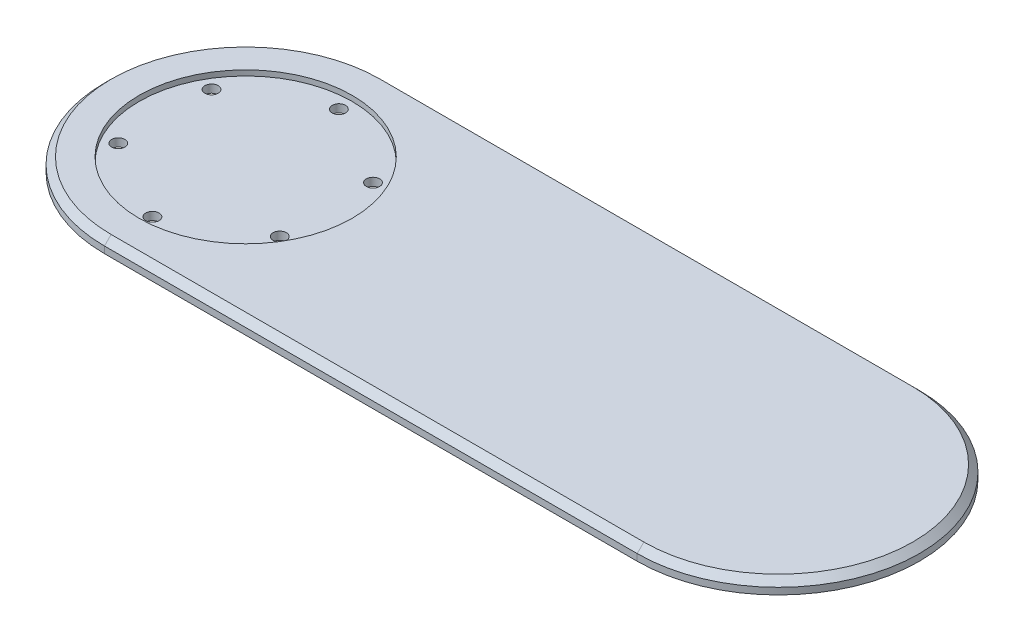
ISO-10303-21;
HEADER;
FILE_DESCRIPTION(('STEP AP214'),'2;1');
FILE_NAME('part.step','',(''),(''),'','','');
FILE_SCHEMA(('AUTOMOTIVE_DESIGN { 1 0 10303 214 1 1 1 1 }'));
ENDSEC;
DATA;
#1=APPLICATION_CONTEXT('core data for automotive mechanical design processes');
#2=APPLICATION_PROTOCOL_DEFINITION('international standard','automotive_design',2000,#1);
#3=PRODUCT_CONTEXT('',#1,'mechanical');
#4=PRODUCT('Part','Part','',(#3));
#5=PRODUCT_RELATED_PRODUCT_CATEGORY('part','',(#4));
#6=PRODUCT_DEFINITION_FORMATION('','',#4);
#7=PRODUCT_DEFINITION_CONTEXT('part definition',#1,'design');
#8=PRODUCT_DEFINITION('design','',#6,#7);
#9=PRODUCT_DEFINITION_SHAPE('','',#8);
#10=(LENGTH_UNIT() NAMED_UNIT(*) SI_UNIT(.MILLI.,.METRE.));
#11=(NAMED_UNIT(*) PLANE_ANGLE_UNIT() SI_UNIT($,.RADIAN.));
#12=(NAMED_UNIT(*) SI_UNIT($,.STERADIAN.) SOLID_ANGLE_UNIT());
#13=UNCERTAINTY_MEASURE_WITH_UNIT(LENGTH_MEASURE(1.E-05),#10,'distance_accuracy_value','');
#14=(GEOMETRIC_REPRESENTATION_CONTEXT(3) GLOBAL_UNCERTAINTY_ASSIGNED_CONTEXT((#13)) GLOBAL_UNIT_ASSIGNED_CONTEXT((#10,
#11,#12)) REPRESENTATION_CONTEXT('',''));
#15=CARTESIAN_POINT('',(0.,0.,0.));
#16=DIRECTION('',(0.,0.,1.));
#17=DIRECTION('',(1.,0.,0.));
#18=AXIS2_PLACEMENT_3D('',#15,#16,#17);
#19=CARTESIAN_POINT('',(-69.6891108675447,5.,17.5));
#20=DIRECTION('',(0.,-1.,0.));
#21=DIRECTION('',(0.,0.,-1.));
#22=AXIS2_PLACEMENT_3D('',#19,#20,#21);
#23=CYLINDRICAL_SURFACE('',#22,2.5);
#24=CARTESIAN_POINT('',(-69.6891108675447,0.,17.5));
#25=DIRECTION('',(0.,1.,0.));
#26=DIRECTION('',(0.,0.,1.));
#27=AXIS2_PLACEMENT_3D('',#24,#25,#26);
#28=CIRCLE('',#27,2.5);
#29=CARTESIAN_POINT('',(-69.6891108675447,0.,20.));
#30=VERTEX_POINT('',#29);
#31=EDGE_CURVE('E129',#30,#30,#28,.T.);
#32=ORIENTED_EDGE('',*,*,#31,.F.);
#33=EDGE_LOOP('',(#32));
#34=FACE_BOUND('',#33,.T.);
#35=CARTESIAN_POINT('',(-69.6891108675447,3.,17.5));
#36=DIRECTION('',(0.,1.,0.));
#37=DIRECTION('',(0.,0.,1.));
#38=AXIS2_PLACEMENT_3D('',#35,#36,#37);
#39=CIRCLE('',#38,2.5);
#40=CARTESIAN_POINT('',(-69.6891108675447,3.,20.));
#41=VERTEX_POINT('',#40);
#42=EDGE_CURVE('E113',#41,#41,#39,.T.);
#43=ORIENTED_EDGE('',*,*,#42,.T.);
#44=EDGE_LOOP('',(#43));
#45=FACE_BOUND('',#44,.T.);
#46=ADVANCED_FACE('F37',(#34,#45),#23,.F.);
#47=CARTESIAN_POINT('',(-100.,5.,35.));
#48=DIRECTION('',(0.,-1.,0.));
#49=DIRECTION('',(0.,0.,-1.));
#50=AXIS2_PLACEMENT_3D('',#47,#48,#49);
#51=CYLINDRICAL_SURFACE('',#50,2.50000000000001);
#52=CARTESIAN_POINT('',(-100.,0.,35.));
#53=DIRECTION('',(0.,1.,0.));
#54=DIRECTION('',(0.,0.,1.));
#55=AXIS2_PLACEMENT_3D('',#52,#53,#54);
#56=CIRCLE('',#55,2.50000000000001);
#57=CARTESIAN_POINT('',(-100.,0.,37.5));
#58=VERTEX_POINT('',#57);
#59=EDGE_CURVE('E126',#58,#58,#56,.T.);
#60=ORIENTED_EDGE('',*,*,#59,.F.);
#61=EDGE_LOOP('',(#60));
#62=FACE_BOUND('',#61,.T.);
#63=CARTESIAN_POINT('',(-100.,3.,35.));
#64=DIRECTION('',(0.,1.,0.));
#65=DIRECTION('',(0.,0.,1.));
#66=AXIS2_PLACEMENT_3D('',#63,#64,#65);
#67=CIRCLE('',#66,2.50000000000001);
#68=CARTESIAN_POINT('',(-100.,3.,37.5));
#69=VERTEX_POINT('',#68);
#70=EDGE_CURVE('E187',#69,#69,#67,.T.);
#71=ORIENTED_EDGE('',*,*,#70,.T.);
#72=EDGE_LOOP('',(#71));
#73=FACE_BOUND('',#72,.T.);
#74=ADVANCED_FACE('F220',(#62,#73),#51,.F.);
#75=CARTESIAN_POINT('',(-130.310889132455,5.,17.5));
#76=DIRECTION('',(0.,-1.,0.));
#77=DIRECTION('',(0.,0.,-1.));
#78=AXIS2_PLACEMENT_3D('',#75,#76,#77);
#79=CYLINDRICAL_SURFACE('',#78,2.5);
#80=CARTESIAN_POINT('',(-130.310889132455,0.,17.5));
#81=DIRECTION('',(0.,1.,0.));
#82=DIRECTION('',(0.,0.,1.));
#83=AXIS2_PLACEMENT_3D('',#80,#81,#82);
#84=CIRCLE('',#83,2.5);
#85=CARTESIAN_POINT('',(-130.310889132455,0.,20.));
#86=VERTEX_POINT('',#85);
#87=EDGE_CURVE('E123',#86,#86,#84,.T.);
#88=ORIENTED_EDGE('',*,*,#87,.F.);
#89=EDGE_LOOP('',(#88));
#90=FACE_BOUND('',#89,.T.);
#91=CARTESIAN_POINT('',(-130.310889132455,3.,17.5));
#92=DIRECTION('',(0.,1.,0.));
#93=DIRECTION('',(0.,0.,1.));
#94=AXIS2_PLACEMENT_3D('',#91,#92,#93);
#95=CIRCLE('',#94,2.5);
#96=CARTESIAN_POINT('',(-130.310889132455,3.,20.));
#97=VERTEX_POINT('',#96);
#98=EDGE_CURVE('E184',#97,#97,#95,.T.);
#99=ORIENTED_EDGE('',*,*,#98,.T.);
#100=EDGE_LOOP('',(#99));
#101=FACE_BOUND('',#100,.T.);
#102=ADVANCED_FACE('F226',(#90,#101),#79,.F.);
#103=CARTESIAN_POINT('',(-130.310889132455,5.,-17.5));
#104=DIRECTION('',(0.,-1.,0.));
#105=DIRECTION('',(0.,0.,-1.));
#106=AXIS2_PLACEMENT_3D('',#103,#104,#105);
#107=CYLINDRICAL_SURFACE('',#106,2.5);
#108=CARTESIAN_POINT('',(-130.310889132455,0.,-17.5));
#109=DIRECTION('',(0.,1.,0.));
#110=DIRECTION('',(0.,0.,1.));
#111=AXIS2_PLACEMENT_3D('',#108,#109,#110);
#112=CIRCLE('',#111,2.5);
#113=CARTESIAN_POINT('',(-130.310889132455,0.,-15.));
#114=VERTEX_POINT('',#113);
#115=EDGE_CURVE('E120',#114,#114,#112,.T.);
#116=ORIENTED_EDGE('',*,*,#115,.F.);
#117=EDGE_LOOP('',(#116));
#118=FACE_BOUND('',#117,.T.);
#119=CARTESIAN_POINT('',(-130.310889132455,3.,-17.5));
#120=DIRECTION('',(0.,1.,0.));
#121=DIRECTION('',(0.,0.,1.));
#122=AXIS2_PLACEMENT_3D('',#119,#120,#121);
#123=CIRCLE('',#122,2.5);
#124=CARTESIAN_POINT('',(-130.310889132455,3.,-15.));
#125=VERTEX_POINT('',#124);
#126=EDGE_CURVE('E181',#125,#125,#123,.T.);
#127=ORIENTED_EDGE('',*,*,#126,.T.);
#128=EDGE_LOOP('',(#127));
#129=FACE_BOUND('',#128,.T.);
#130=ADVANCED_FACE('F235',(#118,#129),#107,.F.);
#131=CARTESIAN_POINT('',(-100.,5.,-35.));
#132=DIRECTION('',(0.,-1.,0.));
#133=DIRECTION('',(0.,0.,-1.));
#134=AXIS2_PLACEMENT_3D('',#131,#132,#133);
#135=CYLINDRICAL_SURFACE('',#134,2.50000000000001);
#136=CARTESIAN_POINT('',(-100.,0.,-35.));
#137=DIRECTION('',(0.,1.,0.));
#138=DIRECTION('',(0.,0.,1.));
#139=AXIS2_PLACEMENT_3D('',#136,#137,#138);
#140=CIRCLE('',#139,2.50000000000001);
#141=CARTESIAN_POINT('',(-100.,0.,-32.5));
#142=VERTEX_POINT('',#141);
#143=EDGE_CURVE('E110',#142,#142,#140,.T.);
#144=ORIENTED_EDGE('',*,*,#143,.F.);
#145=EDGE_LOOP('',(#144));
#146=FACE_BOUND('',#145,.T.);
#147=CARTESIAN_POINT('',(-100.,3.,-35.));
#148=DIRECTION('',(0.,1.,0.));
#149=DIRECTION('',(0.,0.,1.));
#150=AXIS2_PLACEMENT_3D('',#147,#148,#149);
#151=CIRCLE('',#150,2.50000000000001);
#152=CARTESIAN_POINT('',(-100.,3.,-32.5));
#153=VERTEX_POINT('',#152);
#154=EDGE_CURVE('E142',#153,#153,#151,.T.);
#155=ORIENTED_EDGE('',*,*,#154,.T.);
#156=EDGE_LOOP('',(#155));
#157=FACE_BOUND('',#156,.T.);
#158=ADVANCED_FACE('F239',(#146,#157),#135,.F.);
#159=CARTESIAN_POINT('',(-69.6891108675446,5.,-17.5));
#160=DIRECTION('',(0.,-1.,0.));
#161=DIRECTION('',(0.,0.,-1.));
#162=AXIS2_PLACEMENT_3D('',#159,#160,#161);
#163=CYLINDRICAL_SURFACE('',#162,2.5);
#164=CARTESIAN_POINT('',(-69.6891108675446,0.,-17.5));
#165=DIRECTION('',(0.,1.,0.));
#166=DIRECTION('',(0.,0.,1.));
#167=AXIS2_PLACEMENT_3D('',#164,#165,#166);
#168=CIRCLE('',#167,2.5);
#169=CARTESIAN_POINT('',(-69.6891108675446,0.,-15.));
#170=VERTEX_POINT('',#169);
#171=EDGE_CURVE('E132',#170,#170,#168,.T.);
#172=ORIENTED_EDGE('',*,*,#171,.F.);
#173=EDGE_LOOP('',(#172));
#174=FACE_BOUND('',#173,.T.);
#175=CARTESIAN_POINT('',(-69.6891108675446,3.,-17.5));
#176=DIRECTION('',(0.,1.,0.));
#177=DIRECTION('',(0.,0.,1.));
#178=AXIS2_PLACEMENT_3D('',#175,#176,#177);
#179=CIRCLE('',#178,2.5);
#180=CARTESIAN_POINT('',(-69.6891108675446,3.,-15.));
#181=VERTEX_POINT('',#180);
#182=EDGE_CURVE('E139',#181,#181,#179,.T.);
#183=ORIENTED_EDGE('',*,*,#182,.T.);
#184=EDGE_LOOP('',(#183));
#185=FACE_BOUND('',#184,.T.);
#186=ADVANCED_FACE('F231',(#174,#185),#163,.F.);
#187=CARTESIAN_POINT('',(-100.,5.,0.));
#188=DIRECTION('',(0.,-1.,0.));
#189=DIRECTION('',(0.,0.,-1.));
#190=AXIS2_PLACEMENT_3D('',#187,#188,#189);
#191=CYLINDRICAL_SURFACE('',#190,53.);
#192=DIRECTION('',(0.,-1.,0.));
#193=VECTOR('',#192,1.);
#194=CARTESIAN_POINT('',(-100.,5.,53.));
#195=LINE('',#194,#193);
#196=CARTESIAN_POINT('',(-100.,2.50000000000003,53.));
#197=VERTEX_POINT('',#196);
#198=CARTESIAN_POINT('',(-100.,0.,53.));
#199=VERTEX_POINT('',#198);
#200=EDGE_CURVE('E89',#197,#199,#195,.T.);
#201=ORIENTED_EDGE('',*,*,#200,.F.);
#202=CARTESIAN_POINT('',(-100.,2.50000000000003,0.));
#203=DIRECTION('',(0.,1.,0.));
#204=DIRECTION('',(0.,0.,1.));
#205=AXIS2_PLACEMENT_3D('',#202,#203,#204);
#206=CIRCLE('',#205,53.);
#207=CARTESIAN_POINT('',(-100.,2.50000000000003,-53.));
#208=VERTEX_POINT('',#207);
#209=EDGE_CURVE('E47',#197,#208,#206,.F.);
#210=ORIENTED_EDGE('',*,*,#209,.T.);
#211=DIRECTION('',(0.,-1.,0.));
#212=VECTOR('',#211,1.);
#213=CARTESIAN_POINT('',(-100.,5.,-53.));
#214=LINE('',#213,#212);
#215=CARTESIAN_POINT('',(-100.,0.,-53.));
#216=VERTEX_POINT('',#215);
#217=EDGE_CURVE('E109',#208,#216,#214,.T.);
#218=ORIENTED_EDGE('',*,*,#217,.T.);
#219=CARTESIAN_POINT('',(-100.,0.,0.));
#220=DIRECTION('',(0.,1.,0.));
#221=DIRECTION('',(0.,0.,1.));
#222=AXIS2_PLACEMENT_3D('',#219,#220,#221);
#223=CIRCLE('',#222,53.);
#224=EDGE_CURVE('E103',#216,#199,#223,.T.);
#225=ORIENTED_EDGE('',*,*,#224,.T.);
#226=EDGE_LOOP('',(#201,#210,#218,#225));
#227=FACE_BOUND('',#226,.T.);
#228=ADVANCED_FACE('F108',(#227),#191,.T.);
#229=CARTESIAN_POINT('',(0.,5.,53.));
#230=DIRECTION('',(0.,0.,-1.));
#231=DIRECTION('',(-1.,0.,0.));
#232=AXIS2_PLACEMENT_3D('',#229,#230,#231);
#233=PLANE('',#232);
#234=DIRECTION('',(0.,-1.,0.));
#235=VECTOR('',#234,1.);
#236=CARTESIAN_POINT('',(100.,5.,53.));
#237=LINE('',#236,#235);
#238=CARTESIAN_POINT('',(100.,2.50000000000003,53.));
#239=VERTEX_POINT('',#238);
#240=CARTESIAN_POINT('',(100.,0.,53.));
#241=VERTEX_POINT('',#240);
#242=EDGE_CURVE('E96',#239,#241,#237,.T.);
#243=ORIENTED_EDGE('',*,*,#242,.F.);
#244=DIRECTION('',(-1.,0.,0.));
#245=VECTOR('',#244,1.);
#246=CARTESIAN_POINT('',(-100.,2.50000000000003,53.));
#247=LINE('',#246,#245);
#248=EDGE_CURVE('E11',#239,#197,#247,.T.);
#249=ORIENTED_EDGE('',*,*,#248,.T.);
#250=ORIENTED_EDGE('',*,*,#200,.T.);
#251=DIRECTION('',(1.,0.,0.));
#252=VECTOR('',#251,1.);
#253=CARTESIAN_POINT('',(0.,0.,53.));
#254=LINE('',#253,#252);
#255=EDGE_CURVE('E92',#199,#241,#254,.T.);
#256=ORIENTED_EDGE('',*,*,#255,.T.);
#257=EDGE_LOOP('',(#243,#249,#250,#256));
#258=FACE_BOUND('',#257,.T.);
#259=ADVANCED_FACE('F91',(#258),#233,.F.);
#260=CARTESIAN_POINT('',(100.,5.,0.));
#261=DIRECTION('',(0.,-1.,0.));
#262=DIRECTION('',(0.,0.,-1.));
#263=AXIS2_PLACEMENT_3D('',#260,#261,#262);
#264=CYLINDRICAL_SURFACE('',#263,53.);
#265=DIRECTION('',(0.,-1.,0.));
#266=VECTOR('',#265,1.);
#267=CARTESIAN_POINT('',(100.,5.,-53.));
#268=LINE('',#267,#266);
#269=CARTESIAN_POINT('',(100.,2.50000000000003,-53.));
#270=VERTEX_POINT('',#269);
#271=CARTESIAN_POINT('',(100.,0.,-53.));
#272=VERTEX_POINT('',#271);
#273=EDGE_CURVE('E136',#270,#272,#268,.T.);
#274=ORIENTED_EDGE('',*,*,#273,.F.);
#275=CARTESIAN_POINT('',(100.,2.50000000000003,0.));
#276=DIRECTION('',(0.,1.,0.));
#277=DIRECTION('',(0.,0.,1.));
#278=AXIS2_PLACEMENT_3D('',#275,#276,#277);
#279=CIRCLE('',#278,53.);
#280=EDGE_CURVE('E152',#270,#239,#279,.F.);
#281=ORIENTED_EDGE('',*,*,#280,.T.);
#282=ORIENTED_EDGE('',*,*,#242,.T.);
#283=CARTESIAN_POINT('',(100.,0.,0.));
#284=DIRECTION('',(0.,1.,0.));
#285=DIRECTION('',(0.,0.,1.));
#286=AXIS2_PLACEMENT_3D('',#283,#284,#285);
#287=CIRCLE('',#286,53.);
#288=EDGE_CURVE('E106',#241,#272,#287,.T.);
#289=ORIENTED_EDGE('',*,*,#288,.T.);
#290=EDGE_LOOP('',(#274,#281,#282,#289));
#291=FACE_BOUND('',#290,.T.);
#292=ADVANCED_FACE('F244',(#291),#264,.T.);
#293=CARTESIAN_POINT('',(0.,5.,-53.));
#294=DIRECTION('',(0.,0.,-1.));
#295=DIRECTION('',(-1.,0.,0.));
#296=AXIS2_PLACEMENT_3D('',#293,#294,#295);
#297=PLANE('',#296);
#298=ORIENTED_EDGE('',*,*,#217,.F.);
#299=DIRECTION('',(1.,0.,0.));
#300=VECTOR('',#299,1.);
#301=CARTESIAN_POINT('',(0.,2.50000000000003,-53.));
#302=LINE('',#301,#300);
#303=EDGE_CURVE('E155',#208,#270,#302,.T.);
#304=ORIENTED_EDGE('',*,*,#303,.T.);
#305=ORIENTED_EDGE('',*,*,#273,.T.);
#306=DIRECTION('',(1.,0.,0.));
#307=VECTOR('',#306,1.);
#308=CARTESIAN_POINT('',(0.,0.,-53.));
#309=LINE('',#308,#307);
#310=EDGE_CURVE('E118',#216,#272,#309,.T.);
#311=ORIENTED_EDGE('',*,*,#310,.F.);
#312=EDGE_LOOP('',(#298,#304,#305,#311));
#313=FACE_BOUND('',#312,.T.);
#314=ADVANCED_FACE('F241',(#313),#297,.T.);
#315=CARTESIAN_POINT('',(0.,5.,0.));
#316=DIRECTION('',(0.,1.,0.));
#317=DIRECTION('',(0.,0.,1.));
#318=AXIS2_PLACEMENT_3D('',#315,#316,#317);
#319=PLANE('',#318);
#320=DIRECTION('',(1.,0.,0.));
#321=VECTOR('',#320,1.);
#322=CARTESIAN_POINT('',(100.,5.,50.5));
#323=LINE('',#322,#321);
#324=CARTESIAN_POINT('',(-100.,5.,50.5));
#325=VERTEX_POINT('',#324);
#326=CARTESIAN_POINT('',(100.,5.,50.5));
#327=VERTEX_POINT('',#326);
#328=EDGE_CURVE('E95',#325,#327,#323,.T.);
#329=ORIENTED_EDGE('',*,*,#328,.T.);
#330=CARTESIAN_POINT('',(100.,5.,0.));
#331=DIRECTION('',(0.,1.,0.));
#332=DIRECTION('',(0.,0.,1.));
#333=AXIS2_PLACEMENT_3D('',#330,#331,#332);
#334=CIRCLE('',#333,50.5);
#335=CARTESIAN_POINT('',(100.,5.,-50.5));
#336=VERTEX_POINT('',#335);
#337=EDGE_CURVE('E149',#327,#336,#334,.T.);
#338=ORIENTED_EDGE('',*,*,#337,.T.);
#339=DIRECTION('',(-1.,0.,0.));
#340=VECTOR('',#339,1.);
#341=CARTESIAN_POINT('',(0.,5.,-50.5));
#342=LINE('',#341,#340);
#343=CARTESIAN_POINT('',(-100.,5.,-50.5));
#344=VERTEX_POINT('',#343);
#345=EDGE_CURVE('E147',#336,#344,#342,.T.);
#346=ORIENTED_EDGE('',*,*,#345,.T.);
#347=CARTESIAN_POINT('',(-100.,5.,0.));
#348=DIRECTION('',(0.,1.,0.));
#349=DIRECTION('',(0.,0.,1.));
#350=AXIS2_PLACEMENT_3D('',#347,#348,#349);
#351=CIRCLE('',#350,50.5);
#352=EDGE_CURVE('E145',#344,#325,#351,.T.);
#353=ORIENTED_EDGE('',*,*,#352,.T.);
#354=EDGE_LOOP('',(#329,#338,#346,#353));
#355=FACE_BOUND('',#354,.T.);
#356=CARTESIAN_POINT('',(-100.,5.,0.));
#357=DIRECTION('',(0.,1.,0.));
#358=DIRECTION('',(0.,0.,1.));
#359=AXIS2_PLACEMENT_3D('',#356,#357,#358);
#360=CIRCLE('',#359,40.);
#361=CARTESIAN_POINT('',(-100.,5.,40.));
#362=VERTEX_POINT('',#361);
#363=EDGE_CURVE('E168',#362,#362,#360,.T.);
#364=ORIENTED_EDGE('',*,*,#363,.F.);
#365=EDGE_LOOP('',(#364));
#366=FACE_BOUND('',#365,.T.);
#367=ADVANCED_FACE('F215',(#355,#366),#319,.T.);
#368=CARTESIAN_POINT('',(0.,0.,0.));
#369=DIRECTION('',(0.,1.,0.));
#370=DIRECTION('',(0.,0.,1.));
#371=AXIS2_PLACEMENT_3D('',#368,#369,#370);
#372=PLANE('',#371);
#373=ORIENTED_EDGE('',*,*,#143,.T.);
#374=EDGE_LOOP('',(#373));
#375=FACE_BOUND('',#374,.T.);
#376=ORIENTED_EDGE('',*,*,#224,.F.);
#377=ORIENTED_EDGE('',*,*,#310,.T.);
#378=ORIENTED_EDGE('',*,*,#288,.F.);
#379=ORIENTED_EDGE('',*,*,#255,.F.);
#380=EDGE_LOOP('',(#376,#377,#378,#379));
#381=FACE_BOUND('',#380,.T.);
#382=ORIENTED_EDGE('',*,*,#115,.T.);
#383=EDGE_LOOP('',(#382));
#384=FACE_BOUND('',#383,.T.);
#385=ORIENTED_EDGE('',*,*,#87,.T.);
#386=EDGE_LOOP('',(#385));
#387=FACE_BOUND('',#386,.T.);
#388=ORIENTED_EDGE('',*,*,#59,.T.);
#389=EDGE_LOOP('',(#388));
#390=FACE_BOUND('',#389,.T.);
#391=ORIENTED_EDGE('',*,*,#31,.T.);
#392=EDGE_LOOP('',(#391));
#393=FACE_BOUND('',#392,.T.);
#394=ORIENTED_EDGE('',*,*,#171,.T.);
#395=EDGE_LOOP('',(#394));
#396=FACE_BOUND('',#395,.T.);
#397=ADVANCED_FACE('F100',(#375,#381,#384,#387,#390,#393,#396),#372,.F.);
#398=CARTESIAN_POINT('',(-100.,3.,0.));
#399=DIRECTION('',(0.,1.,0.));
#400=DIRECTION('',(0.,0.,1.));
#401=AXIS2_PLACEMENT_3D('',#398,#399,#400);
#402=CYLINDRICAL_SURFACE('',#401,40.);
#403=CARTESIAN_POINT('',(-100.,3.,0.));
#404=DIRECTION('',(0.,1.,0.));
#405=DIRECTION('',(0.,0.,1.));
#406=AXIS2_PLACEMENT_3D('',#403,#404,#405);
#407=CIRCLE('',#406,40.);
#408=CARTESIAN_POINT('',(-100.,3.,40.));
#409=VERTEX_POINT('',#408);
#410=EDGE_CURVE('E143',#409,#409,#407,.T.);
#411=ORIENTED_EDGE('',*,*,#410,.F.);
#412=EDGE_LOOP('',(#411));
#413=FACE_BOUND('',#412,.T.);
#414=ORIENTED_EDGE('',*,*,#363,.T.);
#415=EDGE_LOOP('',(#414));
#416=FACE_BOUND('',#415,.T.);
#417=ADVANCED_FACE('F196',(#413,#416),#402,.F.);
#418=CARTESIAN_POINT('',(-100.,3.,0.));
#419=DIRECTION('',(0.,1.,0.));
#420=DIRECTION('',(0.,0.,1.));
#421=AXIS2_PLACEMENT_3D('',#418,#419,#420);
#422=PLANE('',#421);
#423=ORIENTED_EDGE('',*,*,#42,.F.);
#424=EDGE_LOOP('',(#423));
#425=FACE_BOUND('',#424,.T.);
#426=ORIENTED_EDGE('',*,*,#70,.F.);
#427=EDGE_LOOP('',(#426));
#428=FACE_BOUND('',#427,.T.);
#429=ORIENTED_EDGE('',*,*,#98,.F.);
#430=EDGE_LOOP('',(#429));
#431=FACE_BOUND('',#430,.T.);
#432=ORIENTED_EDGE('',*,*,#126,.F.);
#433=EDGE_LOOP('',(#432));
#434=FACE_BOUND('',#433,.T.);
#435=ORIENTED_EDGE('',*,*,#154,.F.);
#436=EDGE_LOOP('',(#435));
#437=FACE_BOUND('',#436,.T.);
#438=ORIENTED_EDGE('',*,*,#182,.F.);
#439=EDGE_LOOP('',(#438));
#440=FACE_BOUND('',#439,.T.);
#441=ORIENTED_EDGE('',*,*,#410,.T.);
#442=EDGE_LOOP('',(#441));
#443=FACE_BOUND('',#442,.T.);
#444=ADVANCED_FACE('F193',(#425,#428,#431,#434,#437,#440,#443),#422,.T.);
#445=CARTESIAN_POINT('',(-100.,5.,0.));
#446=DIRECTION('',(0.,-1.,0.));
#447=DIRECTION('',(0.,0.,-1.));
#448=AXIS2_PLACEMENT_3D('',#445,#446,#447);
#449=CONICAL_SURFACE('',#448,50.5,0.785398163397448);
#450=DIRECTION('',(0.,0.707106781186547,0.707106781186547));
#451=VECTOR('',#450,1.);
#452=CARTESIAN_POINT('',(-100.,2.50000000000003,-53.));
#453=LINE('',#452,#451);
#454=EDGE_CURVE('E161',#208,#344,#453,.T.);
#455=ORIENTED_EDGE('',*,*,#454,.F.);
#456=ORIENTED_EDGE('',*,*,#209,.F.);
#457=DIRECTION('',(0.,-0.707106781186547,0.707106781186547));
#458=VECTOR('',#457,1.);
#459=CARTESIAN_POINT('',(-100.,5.,50.5));
#460=LINE('',#459,#458);
#461=EDGE_CURVE('E42',#325,#197,#460,.T.);
#462=ORIENTED_EDGE('',*,*,#461,.F.);
#463=ORIENTED_EDGE('',*,*,#352,.F.);
#464=EDGE_LOOP('',(#455,#456,#462,#463));
#465=FACE_BOUND('',#464,.T.);
#466=ADVANCED_FACE('F40',(#465),#449,.T.);
#467=CARTESIAN_POINT('',(0.,5.,50.5));
#468=DIRECTION('',(0.,0.707106781186546,0.707106781186548));
#469=DIRECTION('',(-1.,0.,0.));
#470=AXIS2_PLACEMENT_3D('',#467,#468,#469);
#471=PLANE('',#470);
#472=ORIENTED_EDGE('',*,*,#461,.T.);
#473=ORIENTED_EDGE('',*,*,#248,.F.);
#474=DIRECTION('',(0.,-0.707106781186548,0.707106781186546));
#475=VECTOR('',#474,1.);
#476=CARTESIAN_POINT('',(100.,5.,50.5));
#477=LINE('',#476,#475);
#478=EDGE_CURVE('E160',#327,#239,#477,.T.);
#479=ORIENTED_EDGE('',*,*,#478,.F.);
#480=ORIENTED_EDGE('',*,*,#328,.F.);
#481=EDGE_LOOP('',(#472,#473,#479,#480));
#482=FACE_BOUND('',#481,.T.);
#483=ADVANCED_FACE('F269',(#482),#471,.T.);
#484=CARTESIAN_POINT('',(0.,2.50000000000003,-53.));
#485=DIRECTION('',(0.,-0.707106781186546,0.707106781186548));
#486=DIRECTION('',(1.,0.,0.));
#487=AXIS2_PLACEMENT_3D('',#484,#485,#486);
#488=PLANE('',#487);
#489=ORIENTED_EDGE('',*,*,#454,.T.);
#490=ORIENTED_EDGE('',*,*,#345,.F.);
#491=DIRECTION('',(0.,0.707106781186548,0.707106781186546));
#492=VECTOR('',#491,1.);
#493=CARTESIAN_POINT('',(100.,2.50000000000003,-53.));
#494=LINE('',#493,#492);
#495=EDGE_CURVE('E158',#270,#336,#494,.T.);
#496=ORIENTED_EDGE('',*,*,#495,.F.);
#497=ORIENTED_EDGE('',*,*,#303,.F.);
#498=EDGE_LOOP('',(#489,#490,#496,#497));
#499=FACE_BOUND('',#498,.T.);
#500=ADVANCED_FACE('F263',(#499),#488,.F.);
#501=CARTESIAN_POINT('',(100.,5.,0.));
#502=DIRECTION('',(0.,-1.,0.));
#503=DIRECTION('',(0.,0.,-1.));
#504=AXIS2_PLACEMENT_3D('',#501,#502,#503);
#505=CONICAL_SURFACE('',#504,50.5,0.785398163397448);
#506=ORIENTED_EDGE('',*,*,#478,.T.);
#507=ORIENTED_EDGE('',*,*,#280,.F.);
#508=ORIENTED_EDGE('',*,*,#495,.T.);
#509=ORIENTED_EDGE('',*,*,#337,.F.);
#510=EDGE_LOOP('',(#506,#507,#508,#509));
#511=FACE_BOUND('',#510,.T.);
#512=ADVANCED_FACE('F257',(#511),#505,.T.);
#513=CLOSED_SHELL('',(#46,#74,#102,#130,#158,#186,#228,#259,#292,#314,#367,#397,#417,#444,#466,
#483,#500,#512));
#514=MANIFOLD_SOLID_BREP('B2',#513);
#515=ADVANCED_BREP_SHAPE_REPRESENTATION('',(#18,#514),#14);
#516=SHAPE_DEFINITION_REPRESENTATION(#9,#515);
ENDSEC;
END-ISO-10303-21;
